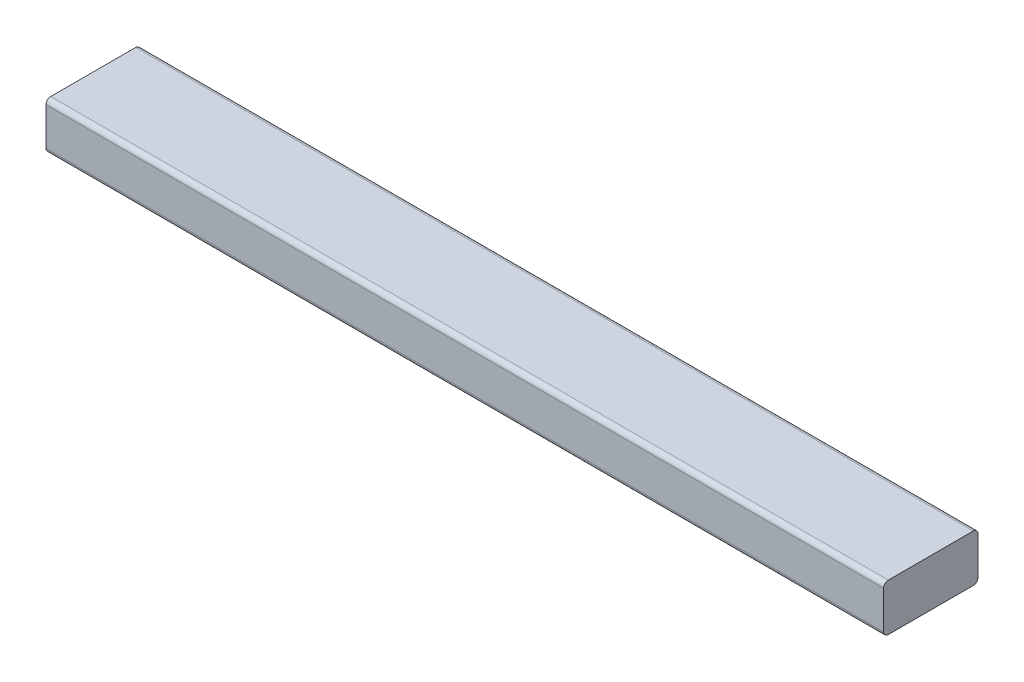
ISO-10303-21;
HEADER;
FILE_DESCRIPTION(('STEP AP214'),'2;1');
FILE_NAME('part.step','',(''),(''),'','','');
FILE_SCHEMA(('AUTOMOTIVE_DESIGN { 1 0 10303 214 1 1 1 1 }'));
ENDSEC;
DATA;
#1=APPLICATION_CONTEXT('core data for automotive mechanical design processes');
#2=APPLICATION_PROTOCOL_DEFINITION('international standard','automotive_design',2000,#1);
#3=PRODUCT_CONTEXT('',#1,'mechanical');
#4=PRODUCT('Part','Part','',(#3));
#5=PRODUCT_RELATED_PRODUCT_CATEGORY('part','',(#4));
#6=PRODUCT_DEFINITION_FORMATION('','',#4);
#7=PRODUCT_DEFINITION_CONTEXT('part definition',#1,'design');
#8=PRODUCT_DEFINITION('design','',#6,#7);
#9=PRODUCT_DEFINITION_SHAPE('','',#8);
#10=(LENGTH_UNIT() NAMED_UNIT(*) SI_UNIT(.MILLI.,.METRE.));
#11=(NAMED_UNIT(*) PLANE_ANGLE_UNIT() SI_UNIT($,.RADIAN.));
#12=(NAMED_UNIT(*) SI_UNIT($,.STERADIAN.) SOLID_ANGLE_UNIT());
#13=UNCERTAINTY_MEASURE_WITH_UNIT(LENGTH_MEASURE(1.E-05),#10,'distance_accuracy_value','');
#14=(GEOMETRIC_REPRESENTATION_CONTEXT(3) GLOBAL_UNCERTAINTY_ASSIGNED_CONTEXT((#13)) GLOBAL_UNIT_ASSIGNED_CONTEXT((#10,
#11,#12)) REPRESENTATION_CONTEXT('',''));
#15=CARTESIAN_POINT('',(0.,0.,0.));
#16=DIRECTION('',(0.,0.,1.));
#17=DIRECTION('',(1.,0.,0.));
#18=AXIS2_PLACEMENT_3D('',#15,#16,#17);
#19=CARTESIAN_POINT('',(1812.69999999996,38.1000000000061,287.69999999999));
#20=DIRECTION('',(-1.,0.,0.));
#21=DIRECTION('',(0.,-1.,0.));
#22=AXIS2_PLACEMENT_3D('',#19,#20,#21);
#23=PLANE('',#22);
#24=DIRECTION('',(0.,0.,-1.));
#25=VECTOR('',#24,1.);
#26=CARTESIAN_POINT('',(1812.69999999996,38.1000000000061,287.69999999999));
#27=LINE('',#26,#25);
#28=CARTESIAN_POINT('',(1812.69999999996,38.1000000000078,384.21999999999));
#29=VERTEX_POINT('',#28);
#30=CARTESIAN_POINT('',(1812.69999999996,38.1000000000062,292.77999999999));
#31=VERTEX_POINT('',#30);
#32=EDGE_CURVE('E115',#29,#31,#27,.T.);
#33=ORIENTED_EDGE('',*,*,#32,.T.);
#34=CARTESIAN_POINT('',(1812.69999999996,33.0200000000062,292.77999999999));
#35=DIRECTION('',(-1.,0.,0.));
#36=DIRECTION('',(0.,-1.,0.));
#37=AXIS2_PLACEMENT_3D('',#34,#35,#36);
#38=CIRCLE('',#37,5.08);
#39=CARTESIAN_POINT('',(1812.69999999996,33.0200000000061,287.69999999999));
#40=VERTEX_POINT('',#39);
#41=EDGE_CURVE('E110',#31,#40,#38,.T.);
#42=ORIENTED_EDGE('',*,*,#41,.T.);
#43=DIRECTION('',(0.,-1.,0.));
#44=VECTOR('',#43,1.);
#45=CARTESIAN_POINT('',(1812.69999999996,38.1000000000061,287.69999999999));
#46=LINE('',#45,#44);
#47=CARTESIAN_POINT('',(1812.69999999996,-7.61999999999392,287.699999999991));
#48=VERTEX_POINT('',#47);
#49=EDGE_CURVE('E112',#40,#48,#46,.T.);
#50=ORIENTED_EDGE('',*,*,#49,.T.);
#51=CARTESIAN_POINT('',(1812.69999999996,-7.61999999999383,292.779999999991));
#52=DIRECTION('',(-1.,0.,0.));
#53=DIRECTION('',(0.,-1.,0.));
#54=AXIS2_PLACEMENT_3D('',#51,#52,#53);
#55=CIRCLE('',#54,5.08);
#56=CARTESIAN_POINT('',(1812.69999999996,-12.6999999999938,292.779999999991));
#57=VERTEX_POINT('',#56);
#58=EDGE_CURVE('E121',#48,#57,#55,.T.);
#59=ORIENTED_EDGE('',*,*,#58,.T.);
#60=DIRECTION('',(0.,0.,-1.));
#61=VECTOR('',#60,1.);
#62=CARTESIAN_POINT('',(1812.69999999996,-12.6999999999939,287.699999999991));
#63=LINE('',#62,#61);
#64=CARTESIAN_POINT('',(1812.69999999996,-12.6999999999922,384.219999999991));
#65=VERTEX_POINT('',#64);
#66=EDGE_CURVE('E194',#65,#57,#63,.T.);
#67=ORIENTED_EDGE('',*,*,#66,.F.);
#68=CARTESIAN_POINT('',(1812.69999999996,-7.61999999999217,384.219999999991));
#69=DIRECTION('',(-1.,0.,0.));
#70=DIRECTION('',(0.,-1.,0.));
#71=AXIS2_PLACEMENT_3D('',#68,#69,#70);
#72=CIRCLE('',#71,5.08);
#73=CARTESIAN_POINT('',(1812.69999999996,-7.61999999999208,389.299999999991));
#74=VERTEX_POINT('',#73);
#75=EDGE_CURVE('E59',#65,#74,#72,.T.);
#76=ORIENTED_EDGE('',*,*,#75,.T.);
#77=DIRECTION('',(0.,-1.,0.));
#78=VECTOR('',#77,1.);
#79=CARTESIAN_POINT('',(1812.69999999996,38.1000000000079,389.29999999999));
#80=LINE('',#79,#78);
#81=CARTESIAN_POINT('',(1812.69999999996,33.0200000000079,389.29999999999));
#82=VERTEX_POINT('',#81);
#83=EDGE_CURVE('E144',#82,#74,#80,.T.);
#84=ORIENTED_EDGE('',*,*,#83,.F.);
#85=CARTESIAN_POINT('',(1812.69999999996,33.0200000000078,384.21999999999));
#86=DIRECTION('',(-1.,0.,0.));
#87=DIRECTION('',(0.,-1.,0.));
#88=AXIS2_PLACEMENT_3D('',#85,#86,#87);
#89=CIRCLE('',#88,5.08);
#90=EDGE_CURVE('E67',#82,#29,#89,.T.);
#91=ORIENTED_EDGE('',*,*,#90,.T.);
#92=EDGE_LOOP('',(#33,#42,#50,#59,#67,#76,#84,#91));
#93=FACE_BOUND('',#92,.T.);
#94=ADVANCED_FACE('F43',(#93),#23,.T.);
#95=CARTESIAN_POINT('',(1812.69999999996,38.1000000000079,389.29999999999));
#96=DIRECTION('',(0.,0.,1.));
#97=DIRECTION('',(0.,-1.,0.));
#98=AXIS2_PLACEMENT_3D('',#95,#96,#97);
#99=PLANE('',#98);
#100=ORIENTED_EDGE('',*,*,#83,.T.);
#101=DIRECTION('',(-1.,0.,0.));
#102=VECTOR('',#101,1.);
#103=CARTESIAN_POINT('',(2714.29999999996,-7.61999999998736,389.299999999991));
#104=LINE('',#103,#102);
#105=CARTESIAN_POINT('',(2714.29999999996,-7.61999999998737,389.299999999991));
#106=VERTEX_POINT('',#105);
#107=EDGE_CURVE('E11',#74,#106,#104,.F.);
#108=ORIENTED_EDGE('',*,*,#107,.T.);
#109=DIRECTION('',(0.,-1.,0.));
#110=VECTOR('',#109,1.);
#111=CARTESIAN_POINT('',(2714.29999999996,38.1000000000126,389.29999999999));
#112=LINE('',#111,#110);
#113=CARTESIAN_POINT('',(2714.29999999996,33.0200000000126,389.29999999999));
#114=VERTEX_POINT('',#113);
#115=EDGE_CURVE('E178',#114,#106,#112,.T.);
#116=ORIENTED_EDGE('',*,*,#115,.F.);
#117=DIRECTION('',(-1.,0.,0.));
#118=VECTOR('',#117,1.);
#119=CARTESIAN_POINT('',(1812.69999999996,33.0200000000079,389.29999999999));
#120=LINE('',#119,#118);
#121=EDGE_CURVE('E52',#114,#82,#120,.T.);
#122=ORIENTED_EDGE('',*,*,#121,.T.);
#123=EDGE_LOOP('',(#100,#108,#116,#122));
#124=FACE_BOUND('',#123,.T.);
#125=ADVANCED_FACE('F175',(#124),#99,.T.);
#126=CARTESIAN_POINT('',(2714.29999999996,38.1000000000108,287.69999999999));
#127=DIRECTION('',(1.,0.,0.));
#128=DIRECTION('',(0.,1.,0.));
#129=AXIS2_PLACEMENT_3D('',#126,#127,#128);
#130=PLANE('',#129);
#131=DIRECTION('',(0.,-1.,0.));
#132=VECTOR('',#131,1.);
#133=CARTESIAN_POINT('',(2714.29999999996,38.1000000000108,287.69999999999));
#134=LINE('',#133,#132);
#135=CARTESIAN_POINT('',(2714.29999999996,33.0200000000108,287.69999999999));
#136=VERTEX_POINT('',#135);
#137=CARTESIAN_POINT('',(2714.29999999996,-7.61999999998921,287.699999999991));
#138=VERTEX_POINT('',#137);
#139=EDGE_CURVE('E132',#136,#138,#134,.T.);
#140=ORIENTED_EDGE('',*,*,#139,.F.);
#141=CARTESIAN_POINT('',(2714.29999999996,33.0200000000109,292.77999999999));
#142=DIRECTION('',(1.,0.,0.));
#143=DIRECTION('',(0.,1.,0.));
#144=AXIS2_PLACEMENT_3D('',#141,#142,#143);
#145=CIRCLE('',#144,5.08);
#146=CARTESIAN_POINT('',(2714.29999999996,38.1000000000109,292.77999999999));
#147=VERTEX_POINT('',#146);
#148=EDGE_CURVE('E136',#136,#147,#145,.T.);
#149=ORIENTED_EDGE('',*,*,#148,.T.);
#150=DIRECTION('',(0.,0.,1.));
#151=VECTOR('',#150,1.);
#152=CARTESIAN_POINT('',(2714.29999999996,38.1000000000108,287.69999999999));
#153=LINE('',#152,#151);
#154=CARTESIAN_POINT('',(2714.29999999996,38.1000000000125,384.21999999999));
#155=VERTEX_POINT('',#154);
#156=EDGE_CURVE('E133',#147,#155,#153,.T.);
#157=ORIENTED_EDGE('',*,*,#156,.T.);
#158=CARTESIAN_POINT('',(2714.29999999996,33.0200000000125,384.219999999991));
#159=DIRECTION('',(1.,0.,0.));
#160=DIRECTION('',(0.,1.,0.));
#161=AXIS2_PLACEMENT_3D('',#158,#159,#160);
#162=CIRCLE('',#161,5.08);
#163=EDGE_CURVE('E138',#155,#114,#162,.T.);
#164=ORIENTED_EDGE('',*,*,#163,.T.);
#165=ORIENTED_EDGE('',*,*,#115,.T.);
#166=CARTESIAN_POINT('',(2714.29999999996,-7.61999999998746,384.219999999991));
#167=DIRECTION('',(1.,0.,0.));
#168=DIRECTION('',(0.,1.,0.));
#169=AXIS2_PLACEMENT_3D('',#166,#167,#168);
#170=CIRCLE('',#169,5.08);
#171=CARTESIAN_POINT('',(2714.29999999996,-12.6999999999875,384.219999999991));
#172=VERTEX_POINT('',#171);
#173=EDGE_CURVE('E142',#106,#172,#170,.T.);
#174=ORIENTED_EDGE('',*,*,#173,.T.);
#175=DIRECTION('',(0.,0.,1.));
#176=VECTOR('',#175,1.);
#177=CARTESIAN_POINT('',(2714.29999999996,-12.6999999999892,287.699999999991));
#178=LINE('',#177,#176);
#179=CARTESIAN_POINT('',(2714.29999999996,-12.6999999999891,292.779999999991));
#180=VERTEX_POINT('',#179);
#181=EDGE_CURVE('E185',#180,#172,#178,.T.);
#182=ORIENTED_EDGE('',*,*,#181,.F.);
#183=CARTESIAN_POINT('',(2714.29999999996,-7.61999999998911,292.779999999991));
#184=DIRECTION('',(1.,0.,0.));
#185=DIRECTION('',(0.,1.,0.));
#186=AXIS2_PLACEMENT_3D('',#183,#184,#185);
#187=CIRCLE('',#186,5.08);
#188=EDGE_CURVE('E149',#180,#138,#187,.T.);
#189=ORIENTED_EDGE('',*,*,#188,.T.);
#190=EDGE_LOOP('',(#140,#149,#157,#164,#165,#174,#182,#189));
#191=FACE_BOUND('',#190,.T.);
#192=ADVANCED_FACE('F208',(#191),#130,.T.);
#193=CARTESIAN_POINT('',(1812.69999999996,38.1000000000061,287.69999999999));
#194=DIRECTION('',(0.,0.,-1.));
#195=DIRECTION('',(0.,1.,0.));
#196=AXIS2_PLACEMENT_3D('',#193,#194,#195);
#197=PLANE('',#196);
#198=ORIENTED_EDGE('',*,*,#49,.F.);
#199=DIRECTION('',(1.,0.,0.));
#200=VECTOR('',#199,1.);
#201=CARTESIAN_POINT('',(1812.69999999996,33.0200000000061,287.69999999999));
#202=LINE('',#201,#200);
#203=EDGE_CURVE('E127',#40,#136,#202,.T.);
#204=ORIENTED_EDGE('',*,*,#203,.T.);
#205=ORIENTED_EDGE('',*,*,#139,.T.);
#206=DIRECTION('',(1.,0.,0.));
#207=VECTOR('',#206,1.);
#208=CARTESIAN_POINT('',(1812.69999999996,-7.61999999999392,287.699999999991));
#209=LINE('',#208,#207);
#210=EDGE_CURVE('E130',#138,#48,#209,.F.);
#211=ORIENTED_EDGE('',*,*,#210,.T.);
#212=EDGE_LOOP('',(#198,#204,#205,#211));
#213=FACE_BOUND('',#212,.T.);
#214=ADVANCED_FACE('F125',(#213),#197,.T.);
#215=CARTESIAN_POINT('',(-1.99195760763098E-13,38.0999999999914,-6.88847661806863E-13));
#216=DIRECTION('',(0.,1.,0.));
#217=DIRECTION('',(0.,0.,1.));
#218=AXIS2_PLACEMENT_3D('',#215,#216,#217);
#219=PLANE('',#218);
#220=ORIENTED_EDGE('',*,*,#156,.F.);
#221=DIRECTION('',(1.,0.,0.));
#222=VECTOR('',#221,1.);
#223=CARTESIAN_POINT('',(-2.3524845565551E-13,38.0999999999967,292.77999999999));
#224=LINE('',#223,#222);
#225=EDGE_CURVE('E157',#147,#31,#224,.F.);
#226=ORIENTED_EDGE('',*,*,#225,.T.);
#227=ORIENTED_EDGE('',*,*,#32,.F.);
#228=DIRECTION('',(-1.,0.,0.));
#229=VECTOR('',#228,1.);
#230=CARTESIAN_POINT('',(-2.46508304077405E-13,38.0999999999983,384.21999999999));
#231=LINE('',#230,#229);
#232=EDGE_CURVE('E154',#29,#155,#231,.F.);
#233=ORIENTED_EDGE('',*,*,#232,.T.);
#234=EDGE_LOOP('',(#220,#226,#227,#233));
#235=FACE_BOUND('',#234,.T.);
#236=ADVANCED_FACE('F210',(#235),#219,.T.);
#237=CARTESIAN_POINT('',(0.,-12.7000000000086,2.29634020132585E-13));
#238=DIRECTION('',(0.,1.,0.));
#239=DIRECTION('',(0.,0.,1.));
#240=AXIS2_PLACEMENT_3D('',#237,#238,#239);
#241=PLANE('',#240);
#242=ORIENTED_EDGE('',*,*,#66,.T.);
#243=DIRECTION('',(1.,0.,0.));
#244=VECTOR('',#243,1.);
#245=CARTESIAN_POINT('',(2714.29999999996,-12.6999999999891,292.779999999991));
#246=LINE('',#245,#244);
#247=EDGE_CURVE('E169',#57,#180,#246,.T.);
#248=ORIENTED_EDGE('',*,*,#247,.T.);
#249=ORIENTED_EDGE('',*,*,#181,.T.);
#250=DIRECTION('',(-1.,0.,0.));
#251=VECTOR('',#250,1.);
#252=CARTESIAN_POINT('',(1812.69999999996,-12.6999999999922,384.219999999991));
#253=LINE('',#252,#251);
#254=EDGE_CURVE('E120',#172,#65,#253,.T.);
#255=ORIENTED_EDGE('',*,*,#254,.T.);
#256=EDGE_LOOP('',(#242,#248,#249,#255));
#257=FACE_BOUND('',#256,.T.);
#258=ADVANCED_FACE('F196',(#257),#241,.F.);
#259=CARTESIAN_POINT('',(1812.69999999996,33.0200000000062,292.77999999999));
#260=DIRECTION('',(1.,0.,0.));
#261=DIRECTION('',(0.,1.,0.));
#262=AXIS2_PLACEMENT_3D('',#259,#260,#261);
#263=CYLINDRICAL_SURFACE('',#262,5.08);
#264=ORIENTED_EDGE('',*,*,#41,.F.);
#265=ORIENTED_EDGE('',*,*,#225,.F.);
#266=ORIENTED_EDGE('',*,*,#148,.F.);
#267=ORIENTED_EDGE('',*,*,#203,.F.);
#268=EDGE_LOOP('',(#264,#265,#266,#267));
#269=FACE_BOUND('',#268,.T.);
#270=ADVANCED_FACE('F135',(#269),#263,.T.);
#271=CARTESIAN_POINT('',(0.,-7.62000000000331,292.779999999991));
#272=DIRECTION('',(-1.,0.,0.));
#273=DIRECTION('',(0.,-1.,0.));
#274=AXIS2_PLACEMENT_3D('',#271,#272,#273);
#275=CYLINDRICAL_SURFACE('',#274,5.08);
#276=ORIENTED_EDGE('',*,*,#58,.F.);
#277=ORIENTED_EDGE('',*,*,#210,.F.);
#278=ORIENTED_EDGE('',*,*,#188,.F.);
#279=ORIENTED_EDGE('',*,*,#247,.F.);
#280=EDGE_LOOP('',(#276,#277,#278,#279));
#281=FACE_BOUND('',#280,.T.);
#282=ADVANCED_FACE('F191',(#281),#275,.T.);
#283=CARTESIAN_POINT('',(0.,-7.62000000000165,384.219999999991));
#284=DIRECTION('',(1.,0.,0.));
#285=DIRECTION('',(0.,1.,0.));
#286=AXIS2_PLACEMENT_3D('',#283,#284,#285);
#287=CYLINDRICAL_SURFACE('',#286,5.08);
#288=ORIENTED_EDGE('',*,*,#173,.F.);
#289=ORIENTED_EDGE('',*,*,#107,.F.);
#290=ORIENTED_EDGE('',*,*,#75,.F.);
#291=ORIENTED_EDGE('',*,*,#254,.F.);
#292=EDGE_LOOP('',(#288,#289,#290,#291));
#293=FACE_BOUND('',#292,.T.);
#294=ADVANCED_FACE('F230',(#293),#287,.T.);
#295=CARTESIAN_POINT('',(1812.69999999996,33.0200000000078,384.21999999999));
#296=DIRECTION('',(-1.,0.,0.));
#297=DIRECTION('',(0.,-1.,0.));
#298=AXIS2_PLACEMENT_3D('',#295,#296,#297);
#299=CYLINDRICAL_SURFACE('',#298,5.08);
#300=ORIENTED_EDGE('',*,*,#163,.F.);
#301=ORIENTED_EDGE('',*,*,#232,.F.);
#302=ORIENTED_EDGE('',*,*,#90,.F.);
#303=ORIENTED_EDGE('',*,*,#121,.F.);
#304=EDGE_LOOP('',(#300,#301,#302,#303));
#305=FACE_BOUND('',#304,.T.);
#306=ADVANCED_FACE('F45',(#305),#299,.T.);
#307=CLOSED_SHELL('',(#94,#125,#192,#214,#236,#258,#270,#282,#294,#306));
#308=MANIFOLD_SOLID_BREP('B2',#307);
#309=ADVANCED_BREP_SHAPE_REPRESENTATION('',(#18,#308),#14);
#310=SHAPE_DEFINITION_REPRESENTATION(#9,#309);
ENDSEC;
END-ISO-10303-21;
